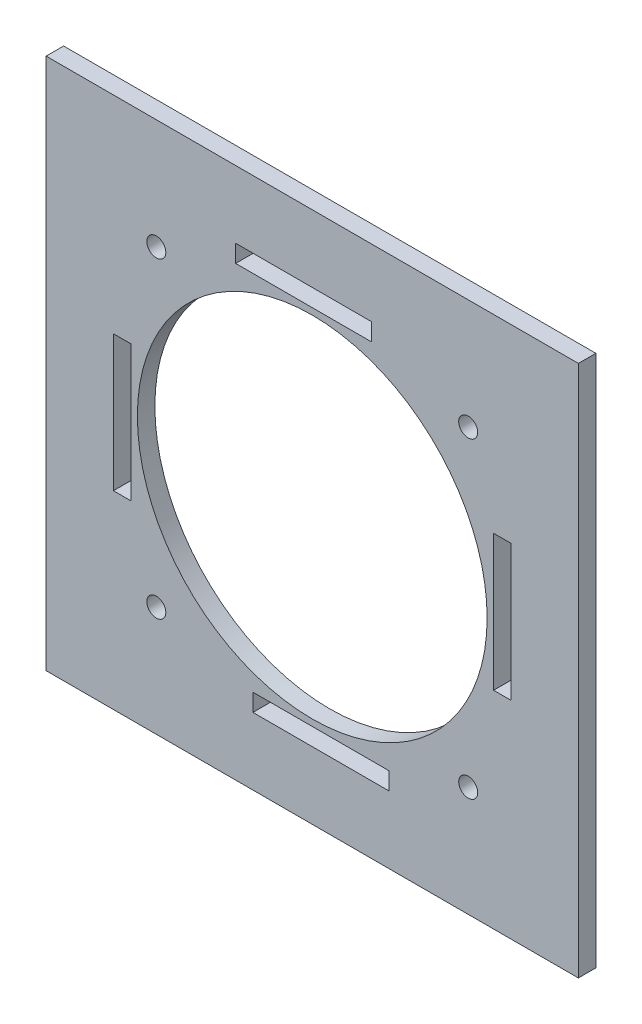
ISO-10303-21;
HEADER;
FILE_DESCRIPTION(('STEP AP214'),'2;1');
FILE_NAME('part.step','',(''),(''),'','','');
FILE_SCHEMA(('AUTOMOTIVE_DESIGN { 1 0 10303 214 1 1 1 1 }'));
ENDSEC;
DATA;
#1=APPLICATION_CONTEXT('core data for automotive mechanical design processes');
#2=APPLICATION_PROTOCOL_DEFINITION('international standard','automotive_design',2000,#1);
#3=PRODUCT_CONTEXT('',#1,'mechanical');
#4=PRODUCT('Part','Part','',(#3));
#5=PRODUCT_RELATED_PRODUCT_CATEGORY('part','',(#4));
#6=PRODUCT_DEFINITION_FORMATION('','',#4);
#7=PRODUCT_DEFINITION_CONTEXT('part definition',#1,'design');
#8=PRODUCT_DEFINITION('design','',#6,#7);
#9=PRODUCT_DEFINITION_SHAPE('','',#8);
#10=(LENGTH_UNIT() NAMED_UNIT(*) SI_UNIT(.MILLI.,.METRE.));
#11=(NAMED_UNIT(*) PLANE_ANGLE_UNIT() SI_UNIT($,.RADIAN.));
#12=(NAMED_UNIT(*) SI_UNIT($,.STERADIAN.) SOLID_ANGLE_UNIT());
#13=UNCERTAINTY_MEASURE_WITH_UNIT(LENGTH_MEASURE(1.E-05),#10,'distance_accuracy_value','');
#14=(GEOMETRIC_REPRESENTATION_CONTEXT(3) GLOBAL_UNCERTAINTY_ASSIGNED_CONTEXT((#13)) GLOBAL_UNIT_ASSIGNED_CONTEXT((#10,
#11,#12)) REPRESENTATION_CONTEXT('',''));
#15=CARTESIAN_POINT('',(0.,0.,0.));
#16=DIRECTION('',(0.,0.,1.));
#17=DIRECTION('',(1.,0.,0.));
#18=AXIS2_PLACEMENT_3D('',#15,#16,#17);
#19=CARTESIAN_POINT('',(70.,70.,4.6));
#20=DIRECTION('',(0.,0.,-1.));
#21=DIRECTION('',(-1.,0.,0.));
#22=AXIS2_PLACEMENT_3D('',#19,#20,#21);
#23=PLANE('',#22);
#24=DIRECTION('',(0.,1.,0.));
#25=VECTOR('',#24,1.);
#26=CARTESIAN_POINT('',(-47.7,-20.1513538884116,4.59999999999999));
#27=LINE('',#26,#25);
#28=CARTESIAN_POINT('',(-47.7,-20.1513538884116,4.59999999999999));
#29=VERTEX_POINT('',#28);
#30=CARTESIAN_POINT('',(-47.7,15.6078197430592,4.6));
#31=VERTEX_POINT('',#30);
#32=EDGE_CURVE('E47',#29,#31,#27,.T.);
#33=ORIENTED_EDGE('',*,*,#32,.F.);
#34=DIRECTION('',(-1.,0.,0.));
#35=VECTOR('',#34,1.);
#36=CARTESIAN_POINT('',(-11.6461722031394,-20.1513538884116,4.59999999999999));
#37=LINE('',#36,#35);
#38=CARTESIAN_POINT('',(-52.3,-20.1513538884116,4.59999999999999));
#39=VERTEX_POINT('',#38);
#40=EDGE_CURVE('E300',#29,#39,#37,.T.);
#41=ORIENTED_EDGE('',*,*,#40,.T.);
#42=DIRECTION('',(0.,1.,0.));
#43=VECTOR('',#42,1.);
#44=CARTESIAN_POINT('',(-52.3,-20.1513538884116,4.59999999999999));
#45=LINE('',#44,#43);
#46=CARTESIAN_POINT('',(-52.3,15.6078197430592,4.59999999999999));
#47=VERTEX_POINT('',#46);
#48=EDGE_CURVE('E293',#39,#47,#45,.T.);
#49=ORIENTED_EDGE('',*,*,#48,.T.);
#50=DIRECTION('',(-1.,0.,0.));
#51=VECTOR('',#50,1.);
#52=CARTESIAN_POINT('',(-11.6461722031394,15.6078197430592,4.6));
#53=LINE('',#52,#51);
#54=EDGE_CURVE('E299',#31,#47,#53,.T.);
#55=ORIENTED_EDGE('',*,*,#54,.F.);
#56=EDGE_LOOP('',(#33,#41,#49,#55));
#57=FACE_BOUND('',#56,.T.);
#58=DIRECTION('',(0.,-1.,0.));
#59=VECTOR('',#58,1.);
#60=CARTESIAN_POINT('',(47.7,20.1513538884117,4.6));
#61=LINE('',#60,#59);
#62=CARTESIAN_POINT('',(47.7,20.1513538884117,4.6));
#63=VERTEX_POINT('',#62);
#64=CARTESIAN_POINT('',(47.7,-15.6078197430591,4.6));
#65=VERTEX_POINT('',#64);
#66=EDGE_CURVE('E55',#63,#65,#61,.T.);
#67=ORIENTED_EDGE('',*,*,#66,.F.);
#68=DIRECTION('',(1.,0.,0.));
#69=VECTOR('',#68,1.);
#70=CARTESIAN_POINT('',(11.6461722031394,20.1513538884117,4.6));
#71=LINE('',#70,#69);
#72=CARTESIAN_POINT('',(52.3,20.1513538884117,4.6));
#73=VERTEX_POINT('',#72);
#74=EDGE_CURVE('E265',#63,#73,#71,.T.);
#75=ORIENTED_EDGE('',*,*,#74,.T.);
#76=DIRECTION('',(0.,-1.,0.));
#77=VECTOR('',#76,1.);
#78=CARTESIAN_POINT('',(52.3,20.1513538884117,4.6));
#79=LINE('',#78,#77);
#80=CARTESIAN_POINT('',(52.3,-15.6078197430591,4.6));
#81=VERTEX_POINT('',#80);
#82=EDGE_CURVE('E258',#73,#81,#79,.T.);
#83=ORIENTED_EDGE('',*,*,#82,.T.);
#84=DIRECTION('',(1.,0.,0.));
#85=VECTOR('',#84,1.);
#86=CARTESIAN_POINT('',(11.6461722031394,-15.6078197430591,4.59999999999999));
#87=LINE('',#86,#85);
#88=EDGE_CURVE('E264',#65,#81,#87,.T.);
#89=ORIENTED_EDGE('',*,*,#88,.F.);
#90=EDGE_LOOP('',(#67,#75,#83,#89));
#91=FACE_BOUND('',#90,.T.);
#92=DIRECTION('',(1.,0.,0.));
#93=VECTOR('',#92,1.);
#94=CARTESIAN_POINT('',(-20.1513538884117,47.7,4.6));
#95=LINE('',#94,#93);
#96=CARTESIAN_POINT('',(-20.1513538884117,47.7,4.6));
#97=VERTEX_POINT('',#96);
#98=CARTESIAN_POINT('',(15.6078197430591,47.7,4.6));
#99=VERTEX_POINT('',#98);
#100=EDGE_CURVE('E226',#97,#99,#95,.T.);
#101=ORIENTED_EDGE('',*,*,#100,.F.);
#102=DIRECTION('',(0.,1.,0.));
#103=VECTOR('',#102,1.);
#104=CARTESIAN_POINT('',(-20.1513538884117,11.6461722031394,4.6));
#105=LINE('',#104,#103);
#106=CARTESIAN_POINT('',(-20.1513538884117,52.3,4.6));
#107=VERTEX_POINT('',#106);
#108=EDGE_CURVE('E229',#97,#107,#105,.T.);
#109=ORIENTED_EDGE('',*,*,#108,.T.);
#110=DIRECTION('',(1.,0.,0.));
#111=VECTOR('',#110,1.);
#112=CARTESIAN_POINT('',(-20.1513538884117,52.3,4.6));
#113=LINE('',#112,#111);
#114=CARTESIAN_POINT('',(15.6078197430591,52.3,4.60000000000001));
#115=VERTEX_POINT('',#114);
#116=EDGE_CURVE('E221',#107,#115,#113,.T.);
#117=ORIENTED_EDGE('',*,*,#116,.T.);
#118=DIRECTION('',(0.,1.,0.));
#119=VECTOR('',#118,1.);
#120=CARTESIAN_POINT('',(15.6078197430591,11.6461722031394,4.6));
#121=LINE('',#120,#119);
#122=EDGE_CURVE('E228',#99,#115,#121,.T.);
#123=ORIENTED_EDGE('',*,*,#122,.F.);
#124=EDGE_LOOP('',(#101,#109,#117,#123));
#125=FACE_BOUND('',#124,.T.);
#126=DIRECTION('',(-1.,0.,0.));
#127=VECTOR('',#126,1.);
#128=CARTESIAN_POINT('',(20.1513538884116,-47.7,4.6));
#129=LINE('',#128,#127);
#130=CARTESIAN_POINT('',(20.1513538884116,-47.7,4.6));
#131=VERTEX_POINT('',#130);
#132=CARTESIAN_POINT('',(-15.6078197430592,-47.7,4.6));
#133=VERTEX_POINT('',#132);
#134=EDGE_CURVE('E572',#131,#133,#129,.T.);
#135=ORIENTED_EDGE('',*,*,#134,.F.);
#136=DIRECTION('',(0.,-1.,0.));
#137=VECTOR('',#136,1.);
#138=CARTESIAN_POINT('',(20.1513538884116,-11.6461722031394,4.60000000000001));
#139=LINE('',#138,#137);
#140=CARTESIAN_POINT('',(20.1513538884116,-52.3,4.6));
#141=VERTEX_POINT('',#140);
#142=EDGE_CURVE('E190',#131,#141,#139,.T.);
#143=ORIENTED_EDGE('',*,*,#142,.T.);
#144=DIRECTION('',(-1.,0.,0.));
#145=VECTOR('',#144,1.);
#146=CARTESIAN_POINT('',(20.1513538884116,-52.3,4.6));
#147=LINE('',#146,#145);
#148=CARTESIAN_POINT('',(-15.6078197430592,-52.3,4.6));
#149=VERTEX_POINT('',#148);
#150=EDGE_CURVE('E195',#141,#149,#147,.T.);
#151=ORIENTED_EDGE('',*,*,#150,.T.);
#152=DIRECTION('',(0.,-1.,0.));
#153=VECTOR('',#152,1.);
#154=CARTESIAN_POINT('',(-15.6078197430592,-11.6461722031394,4.6));
#155=LINE('',#154,#153);
#156=EDGE_CURVE('E569',#133,#149,#155,.T.);
#157=ORIENTED_EDGE('',*,*,#156,.F.);
#158=EDGE_LOOP('',(#135,#143,#151,#157));
#159=FACE_BOUND('',#158,.T.);
#160=CARTESIAN_POINT('',(0.,0.,4.6));
#161=DIRECTION('',(0.,0.,-1.));
#162=DIRECTION('',(-1.,0.,0.));
#163=AXIS2_PLACEMENT_3D('',#160,#161,#162);
#164=CIRCLE('',#163,46.);
#165=CARTESIAN_POINT('',(-46.,0.,4.6));
#166=VERTEX_POINT('',#165);
#167=EDGE_CURVE('E324',#166,#166,#164,.T.);
#168=ORIENTED_EDGE('',*,*,#167,.T.);
#169=EDGE_LOOP('',(#168));
#170=FACE_BOUND('',#169,.T.);
#171=DIRECTION('',(0.,1.,0.));
#172=VECTOR('',#171,1.);
#173=CARTESIAN_POINT('',(70.,-70.,4.6));
#174=LINE('',#173,#172);
#175=CARTESIAN_POINT('',(70.,-70.,4.6));
#176=VERTEX_POINT('',#175);
#177=CARTESIAN_POINT('',(70.,70.,4.6));
#178=VERTEX_POINT('',#177);
#179=EDGE_CURVE('E343',#176,#178,#174,.T.);
#180=ORIENTED_EDGE('',*,*,#179,.T.);
#181=DIRECTION('',(-1.,0.,0.));
#182=VECTOR('',#181,1.);
#183=CARTESIAN_POINT('',(-70.,70.,4.6));
#184=LINE('',#183,#182);
#185=CARTESIAN_POINT('',(-70.,70.,4.6));
#186=VERTEX_POINT('',#185);
#187=EDGE_CURVE('E346',#178,#186,#184,.T.);
#188=ORIENTED_EDGE('',*,*,#187,.T.);
#189=DIRECTION('',(0.,-1.,0.));
#190=VECTOR('',#189,1.);
#191=CARTESIAN_POINT('',(-70.,-70.,4.6));
#192=LINE('',#191,#190);
#193=CARTESIAN_POINT('',(-70.,-70.,4.6));
#194=VERTEX_POINT('',#193);
#195=EDGE_CURVE('E349',#186,#194,#192,.T.);
#196=ORIENTED_EDGE('',*,*,#195,.T.);
#197=DIRECTION('',(1.,0.,0.));
#198=VECTOR('',#197,1.);
#199=CARTESIAN_POINT('',(-70.,-70.,4.6));
#200=LINE('',#199,#198);
#201=EDGE_CURVE('E351',#194,#176,#200,.T.);
#202=ORIENTED_EDGE('',*,*,#201,.T.);
#203=EDGE_LOOP('',(#180,#188,#196,#202));
#204=FACE_BOUND('',#203,.T.);
#205=CARTESIAN_POINT('',(-41.0200000000004,41.0199999999996,4.6));
#206=DIRECTION('',(0.,0.,-1.));
#207=DIRECTION('',(-1.,0.,0.));
#208=AXIS2_PLACEMENT_3D('',#205,#206,#207);
#209=CIRCLE('',#208,2.5);
#210=CARTESIAN_POINT('',(-43.5200000000004,41.0199999999996,4.6));
#211=VERTEX_POINT('',#210);
#212=EDGE_CURVE('E330',#211,#211,#209,.T.);
#213=ORIENTED_EDGE('',*,*,#212,.T.);
#214=EDGE_LOOP('',(#213));
#215=FACE_BOUND('',#214,.T.);
#216=CARTESIAN_POINT('',(41.0199999999997,41.0200000000003,4.6));
#217=DIRECTION('',(0.,0.,-1.));
#218=DIRECTION('',(-1.,0.,0.));
#219=AXIS2_PLACEMENT_3D('',#216,#217,#218);
#220=CIRCLE('',#219,2.5);
#221=CARTESIAN_POINT('',(38.5199999999997,41.0200000000003,4.6));
#222=VERTEX_POINT('',#221);
#223=EDGE_CURVE('E333',#222,#222,#220,.T.);
#224=ORIENTED_EDGE('',*,*,#223,.T.);
#225=EDGE_LOOP('',(#224));
#226=FACE_BOUND('',#225,.T.);
#227=CARTESIAN_POINT('',(41.0200000000002,-41.0199999999998,4.6));
#228=DIRECTION('',(0.,0.,-1.));
#229=DIRECTION('',(-1.,0.,0.));
#230=AXIS2_PLACEMENT_3D('',#227,#228,#229);
#231=CIRCLE('',#230,2.5);
#232=CARTESIAN_POINT('',(38.5200000000002,-41.0199999999998,4.6));
#233=VERTEX_POINT('',#232);
#234=EDGE_CURVE('E336',#233,#233,#231,.T.);
#235=ORIENTED_EDGE('',*,*,#234,.T.);
#236=EDGE_LOOP('',(#235));
#237=FACE_BOUND('',#236,.T.);
#238=CARTESIAN_POINT('',(-41.02,-41.02,4.6));
#239=DIRECTION('',(0.,0.,-1.));
#240=DIRECTION('',(-1.,0.,0.));
#241=AXIS2_PLACEMENT_3D('',#238,#239,#240);
#242=CIRCLE('',#241,2.5);
#243=CARTESIAN_POINT('',(-43.52,-41.02,4.6));
#244=VERTEX_POINT('',#243);
#245=EDGE_CURVE('E339',#244,#244,#242,.T.);
#246=ORIENTED_EDGE('',*,*,#245,.T.);
#247=EDGE_LOOP('',(#246));
#248=FACE_BOUND('',#247,.T.);
#249=ADVANCED_FACE('F31',(#57,#91,#125,#159,#170,#204,#215,#226,#237,#248),#23,.F.);
#250=CARTESIAN_POINT('',(70.,70.,0.));
#251=DIRECTION('',(0.,0.,-1.));
#252=DIRECTION('',(-1.,0.,0.));
#253=AXIS2_PLACEMENT_3D('',#250,#251,#252);
#254=PLANE('',#253);
#255=DIRECTION('',(-1.,0.,0.));
#256=VECTOR('',#255,1.);
#257=CARTESIAN_POINT('',(-11.6461722031394,15.6078197430592,0.));
#258=LINE('',#257,#256);
#259=CARTESIAN_POINT('',(-47.7,15.6078197430592,0.));
#260=VERTEX_POINT('',#259);
#261=CARTESIAN_POINT('',(-52.3,15.6078197430592,0.));
#262=VERTEX_POINT('',#261);
#263=EDGE_CURVE('E319',#260,#262,#258,.T.);
#264=ORIENTED_EDGE('',*,*,#263,.T.);
#265=DIRECTION('',(0.,-1.,0.));
#266=VECTOR('',#265,1.);
#267=CARTESIAN_POINT('',(-52.3,70.,0.));
#268=LINE('',#267,#266);
#269=CARTESIAN_POINT('',(-52.3,-20.1513538884116,0.));
#270=VERTEX_POINT('',#269);
#271=EDGE_CURVE('E399',#262,#270,#268,.T.);
#272=ORIENTED_EDGE('',*,*,#271,.T.);
#273=DIRECTION('',(-1.,0.,0.));
#274=VECTOR('',#273,1.);
#275=CARTESIAN_POINT('',(-11.6461722031394,-20.1513538884116,0.));
#276=LINE('',#275,#274);
#277=CARTESIAN_POINT('',(-47.7,-20.1513538884116,0.));
#278=VERTEX_POINT('',#277);
#279=EDGE_CURVE('E296',#278,#270,#276,.T.);
#280=ORIENTED_EDGE('',*,*,#279,.F.);
#281=DIRECTION('',(0.,-1.,0.));
#282=VECTOR('',#281,1.);
#283=CARTESIAN_POINT('',(-47.7,70.,0.));
#284=LINE('',#283,#282);
#285=EDGE_CURVE('E11',#260,#278,#284,.T.);
#286=ORIENTED_EDGE('',*,*,#285,.F.);
#287=EDGE_LOOP('',(#264,#272,#280,#286));
#288=FACE_BOUND('',#287,.T.);
#289=DIRECTION('',(0.,-1.,0.));
#290=VECTOR('',#289,1.);
#291=CARTESIAN_POINT('',(-15.6078197430592,-11.6461722031394,0.));
#292=LINE('',#291,#290);
#293=CARTESIAN_POINT('',(-15.6078197430592,-47.7,0.));
#294=VERTEX_POINT('',#293);
#295=CARTESIAN_POINT('',(-15.6078197430592,-52.3,0.));
#296=VERTEX_POINT('',#295);
#297=EDGE_CURVE('E211',#294,#296,#292,.T.);
#298=ORIENTED_EDGE('',*,*,#297,.T.);
#299=DIRECTION('',(1.,0.,0.));
#300=VECTOR('',#299,1.);
#301=CARTESIAN_POINT('',(70.,-52.3,0.));
#302=LINE('',#301,#300);
#303=CARTESIAN_POINT('',(20.1513538884116,-52.3,0.));
#304=VERTEX_POINT('',#303);
#305=EDGE_CURVE('E181',#296,#304,#302,.T.);
#306=ORIENTED_EDGE('',*,*,#305,.T.);
#307=DIRECTION('',(0.,-1.,0.));
#308=VECTOR('',#307,1.);
#309=CARTESIAN_POINT('',(20.1513538884116,-11.6461722031394,0.));
#310=LINE('',#309,#308);
#311=CARTESIAN_POINT('',(20.1513538884116,-47.7,0.));
#312=VERTEX_POINT('',#311);
#313=EDGE_CURVE('E187',#312,#304,#310,.T.);
#314=ORIENTED_EDGE('',*,*,#313,.F.);
#315=DIRECTION('',(1.,0.,0.));
#316=VECTOR('',#315,1.);
#317=CARTESIAN_POINT('',(70.,-47.7,0.));
#318=LINE('',#317,#316);
#319=EDGE_CURVE('E170',#294,#312,#318,.T.);
#320=ORIENTED_EDGE('',*,*,#319,.F.);
#321=EDGE_LOOP('',(#298,#306,#314,#320));
#322=FACE_BOUND('',#321,.T.);
#323=DIRECTION('',(0.,1.,0.));
#324=VECTOR('',#323,1.);
#325=CARTESIAN_POINT('',(15.6078197430591,11.6461722031394,0.));
#326=LINE('',#325,#324);
#327=CARTESIAN_POINT('',(15.6078197430591,47.7,0.));
#328=VERTEX_POINT('',#327);
#329=CARTESIAN_POINT('',(15.6078197430591,52.3,0.));
#330=VERTEX_POINT('',#329);
#331=EDGE_CURVE('E249',#328,#330,#326,.T.);
#332=ORIENTED_EDGE('',*,*,#331,.T.);
#333=DIRECTION('',(-1.,0.,0.));
#334=VECTOR('',#333,1.);
#335=CARTESIAN_POINT('',(70.,52.3,0.));
#336=LINE('',#335,#334);
#337=CARTESIAN_POINT('',(-20.1513538884117,52.3,0.));
#338=VERTEX_POINT('',#337);
#339=EDGE_CURVE('E405',#330,#338,#336,.T.);
#340=ORIENTED_EDGE('',*,*,#339,.T.);
#341=DIRECTION('',(0.,1.,0.));
#342=VECTOR('',#341,1.);
#343=CARTESIAN_POINT('',(-20.1513538884117,11.6461722031394,0.));
#344=LINE('',#343,#342);
#345=CARTESIAN_POINT('',(-20.1513538884117,47.7,0.));
#346=VERTEX_POINT('',#345);
#347=EDGE_CURVE('E224',#346,#338,#344,.T.);
#348=ORIENTED_EDGE('',*,*,#347,.F.);
#349=DIRECTION('',(-1.,0.,0.));
#350=VECTOR('',#349,1.);
#351=CARTESIAN_POINT('',(70.,47.7,0.));
#352=LINE('',#351,#350);
#353=EDGE_CURVE('E396',#328,#346,#352,.T.);
#354=ORIENTED_EDGE('',*,*,#353,.F.);
#355=EDGE_LOOP('',(#332,#340,#348,#354));
#356=FACE_BOUND('',#355,.T.);
#357=DIRECTION('',(1.,0.,0.));
#358=VECTOR('',#357,1.);
#359=CARTESIAN_POINT('',(11.6461722031394,-15.6078197430591,0.));
#360=LINE('',#359,#358);
#361=CARTESIAN_POINT('',(47.7,-15.6078197430591,0.));
#362=VERTEX_POINT('',#361);
#363=CARTESIAN_POINT('',(52.3,-15.6078197430591,0.));
#364=VERTEX_POINT('',#363);
#365=EDGE_CURVE('E284',#362,#364,#360,.T.);
#366=ORIENTED_EDGE('',*,*,#365,.T.);
#367=DIRECTION('',(0.,1.,0.));
#368=VECTOR('',#367,1.);
#369=CARTESIAN_POINT('',(52.3,70.,0.));
#370=LINE('',#369,#368);
#371=CARTESIAN_POINT('',(52.3,20.1513538884117,0.));
#372=VERTEX_POINT('',#371);
#373=EDGE_CURVE('E389',#364,#372,#370,.T.);
#374=ORIENTED_EDGE('',*,*,#373,.T.);
#375=DIRECTION('',(1.,0.,0.));
#376=VECTOR('',#375,1.);
#377=CARTESIAN_POINT('',(11.6461722031394,20.1513538884117,0.));
#378=LINE('',#377,#376);
#379=CARTESIAN_POINT('',(47.7,20.1513538884117,0.));
#380=VERTEX_POINT('',#379);
#381=EDGE_CURVE('E261',#380,#372,#378,.T.);
#382=ORIENTED_EDGE('',*,*,#381,.F.);
#383=DIRECTION('',(0.,1.,0.));
#384=VECTOR('',#383,1.);
#385=CARTESIAN_POINT('',(47.7,70.,0.));
#386=LINE('',#385,#384);
#387=EDGE_CURVE('E40',#362,#380,#386,.T.);
#388=ORIENTED_EDGE('',*,*,#387,.F.);
#389=EDGE_LOOP('',(#366,#374,#382,#388));
#390=FACE_BOUND('',#389,.T.);
#391=CARTESIAN_POINT('',(-41.02,-41.02,0.));
#392=DIRECTION('',(0.,0.,-1.));
#393=DIRECTION('',(-1.,0.,0.));
#394=AXIS2_PLACEMENT_3D('',#391,#392,#393);
#395=CIRCLE('',#394,2.5);
#396=CARTESIAN_POINT('',(-43.52,-41.02,0.));
#397=VERTEX_POINT('',#396);
#398=EDGE_CURVE('E358',#397,#397,#395,.F.);
#399=ORIENTED_EDGE('',*,*,#398,.T.);
#400=EDGE_LOOP('',(#399));
#401=FACE_BOUND('',#400,.T.);
#402=CARTESIAN_POINT('',(41.0199999999997,41.0200000000003,0.));
#403=DIRECTION('',(0.,0.,-1.));
#404=DIRECTION('',(-1.,0.,0.));
#405=AXIS2_PLACEMENT_3D('',#402,#403,#404);
#406=CIRCLE('',#405,2.5);
#407=CARTESIAN_POINT('',(38.5199999999997,41.0200000000003,0.));
#408=VERTEX_POINT('',#407);
#409=EDGE_CURVE('E378',#408,#408,#406,.F.);
#410=ORIENTED_EDGE('',*,*,#409,.T.);
#411=EDGE_LOOP('',(#410));
#412=FACE_BOUND('',#411,.T.);
#413=CARTESIAN_POINT('',(0.,0.,0.));
#414=DIRECTION('',(0.,0.,-1.));
#415=DIRECTION('',(-1.,0.,0.));
#416=AXIS2_PLACEMENT_3D('',#413,#414,#415);
#417=CIRCLE('',#416,46.);
#418=CARTESIAN_POINT('',(-46.,0.,0.));
#419=VERTEX_POINT('',#418);
#420=EDGE_CURVE('E342',#419,#419,#417,.F.);
#421=ORIENTED_EDGE('',*,*,#420,.T.);
#422=EDGE_LOOP('',(#421));
#423=FACE_BOUND('',#422,.T.);
#424=CARTESIAN_POINT('',(-41.0200000000004,41.0199999999996,0.));
#425=DIRECTION('',(0.,0.,-1.));
#426=DIRECTION('',(-1.,0.,0.));
#427=AXIS2_PLACEMENT_3D('',#424,#425,#426);
#428=CIRCLE('',#427,2.5);
#429=CARTESIAN_POINT('',(-43.5200000000004,41.0199999999996,0.));
#430=VERTEX_POINT('',#429);
#431=EDGE_CURVE('E375',#430,#430,#428,.F.);
#432=ORIENTED_EDGE('',*,*,#431,.T.);
#433=EDGE_LOOP('',(#432));
#434=FACE_BOUND('',#433,.T.);
#435=CARTESIAN_POINT('',(41.0200000000002,-41.0199999999998,0.));
#436=DIRECTION('',(0.,0.,-1.));
#437=DIRECTION('',(-1.,0.,0.));
#438=AXIS2_PLACEMENT_3D('',#435,#436,#437);
#439=CIRCLE('',#438,2.5);
#440=CARTESIAN_POINT('',(38.5200000000002,-41.0199999999998,0.));
#441=VERTEX_POINT('',#440);
#442=EDGE_CURVE('E381',#441,#441,#439,.F.);
#443=ORIENTED_EDGE('',*,*,#442,.T.);
#444=EDGE_LOOP('',(#443));
#445=FACE_BOUND('',#444,.T.);
#446=DIRECTION('',(0.,1.,0.));
#447=VECTOR('',#446,1.);
#448=CARTESIAN_POINT('',(70.,-70.,0.));
#449=LINE('',#448,#447);
#450=CARTESIAN_POINT('',(70.,-70.,0.));
#451=VERTEX_POINT('',#450);
#452=CARTESIAN_POINT('',(70.,70.,0.));
#453=VERTEX_POINT('',#452);
#454=EDGE_CURVE('E354',#451,#453,#449,.T.);
#455=ORIENTED_EDGE('',*,*,#454,.F.);
#456=DIRECTION('',(1.,0.,0.));
#457=VECTOR('',#456,1.);
#458=CARTESIAN_POINT('',(-70.,-70.,0.));
#459=LINE('',#458,#457);
#460=CARTESIAN_POINT('',(-70.,-70.,0.));
#461=VERTEX_POINT('',#460);
#462=EDGE_CURVE('E347',#461,#451,#459,.T.);
#463=ORIENTED_EDGE('',*,*,#462,.F.);
#464=DIRECTION('',(0.,-1.,0.));
#465=VECTOR('',#464,1.);
#466=CARTESIAN_POINT('',(-70.,-70.,0.));
#467=LINE('',#466,#465);
#468=CARTESIAN_POINT('',(-70.,70.,0.));
#469=VERTEX_POINT('',#468);
#470=EDGE_CURVE('E360',#469,#461,#467,.T.);
#471=ORIENTED_EDGE('',*,*,#470,.F.);
#472=DIRECTION('',(-1.,0.,0.));
#473=VECTOR('',#472,1.);
#474=CARTESIAN_POINT('',(-70.,70.,0.));
#475=LINE('',#474,#473);
#476=EDGE_CURVE('E357',#453,#469,#475,.T.);
#477=ORIENTED_EDGE('',*,*,#476,.F.);
#478=EDGE_LOOP('',(#455,#463,#471,#477));
#479=FACE_BOUND('',#478,.T.);
#480=ADVANCED_FACE('F192',(#288,#322,#356,#390,#401,#412,#423,#434,#445,#479),#254,.T.);
#481=CARTESIAN_POINT('',(70.,-70.,4.6));
#482=DIRECTION('',(-1.,0.,0.));
#483=DIRECTION('',(0.,0.,1.));
#484=AXIS2_PLACEMENT_3D('',#481,#482,#483);
#485=PLANE('',#484);
#486=ORIENTED_EDGE('',*,*,#454,.T.);
#487=DIRECTION('',(0.,0.,-1.));
#488=VECTOR('',#487,1.);
#489=CARTESIAN_POINT('',(70.,70.,4.6));
#490=LINE('',#489,#488);
#491=EDGE_CURVE('E182',#178,#453,#490,.T.);
#492=ORIENTED_EDGE('',*,*,#491,.F.);
#493=ORIENTED_EDGE('',*,*,#179,.F.);
#494=DIRECTION('',(0.,0.,-1.));
#495=VECTOR('',#494,1.);
#496=CARTESIAN_POINT('',(70.,-70.,4.6));
#497=LINE('',#496,#495);
#498=EDGE_CURVE('E353',#176,#451,#497,.T.);
#499=ORIENTED_EDGE('',*,*,#498,.T.);
#500=EDGE_LOOP('',(#486,#492,#493,#499));
#501=FACE_BOUND('',#500,.T.);
#502=ADVANCED_FACE('F33',(#501),#485,.F.);
#503=CARTESIAN_POINT('',(-70.,70.,4.6));
#504=DIRECTION('',(0.,-1.,0.));
#505=DIRECTION('',(0.,0.,-1.));
#506=AXIS2_PLACEMENT_3D('',#503,#504,#505);
#507=PLANE('',#506);
#508=ORIENTED_EDGE('',*,*,#476,.T.);
#509=DIRECTION('',(0.,0.,-1.));
#510=VECTOR('',#509,1.);
#511=CARTESIAN_POINT('',(-70.,70.,4.6));
#512=LINE('',#511,#510);
#513=EDGE_CURVE('E368',#186,#469,#512,.T.);
#514=ORIENTED_EDGE('',*,*,#513,.F.);
#515=ORIENTED_EDGE('',*,*,#187,.F.);
#516=ORIENTED_EDGE('',*,*,#491,.T.);
#517=EDGE_LOOP('',(#508,#514,#515,#516));
#518=FACE_BOUND('',#517,.T.);
#519=ADVANCED_FACE('F454',(#518),#507,.F.);
#520=CARTESIAN_POINT('',(-70.,-70.,4.6));
#521=DIRECTION('',(1.,0.,0.));
#522=DIRECTION('',(0.,0.,-1.));
#523=AXIS2_PLACEMENT_3D('',#520,#521,#522);
#524=PLANE('',#523);
#525=ORIENTED_EDGE('',*,*,#470,.T.);
#526=DIRECTION('',(0.,0.,-1.));
#527=VECTOR('',#526,1.);
#528=CARTESIAN_POINT('',(-70.,-70.,4.6));
#529=LINE('',#528,#527);
#530=EDGE_CURVE('E365',#194,#461,#529,.T.);
#531=ORIENTED_EDGE('',*,*,#530,.F.);
#532=ORIENTED_EDGE('',*,*,#195,.F.);
#533=ORIENTED_EDGE('',*,*,#513,.T.);
#534=EDGE_LOOP('',(#525,#531,#532,#533));
#535=FACE_BOUND('',#534,.T.);
#536=ADVANCED_FACE('F451',(#535),#524,.F.);
#537=CARTESIAN_POINT('',(-70.,-70.,4.6));
#538=DIRECTION('',(0.,1.,0.));
#539=DIRECTION('',(0.,0.,1.));
#540=AXIS2_PLACEMENT_3D('',#537,#538,#539);
#541=PLANE('',#540);
#542=ORIENTED_EDGE('',*,*,#462,.T.);
#543=ORIENTED_EDGE('',*,*,#498,.F.);
#544=ORIENTED_EDGE('',*,*,#201,.F.);
#545=ORIENTED_EDGE('',*,*,#530,.T.);
#546=EDGE_LOOP('',(#542,#543,#544,#545));
#547=FACE_BOUND('',#546,.T.);
#548=ADVANCED_FACE('F447',(#547),#541,.F.);
#549=CARTESIAN_POINT('',(0.,0.,-5.4));
#550=DIRECTION('',(0.,0.,1.));
#551=DIRECTION('',(1.,0.,0.));
#552=AXIS2_PLACEMENT_3D('',#549,#550,#551);
#553=CYLINDRICAL_SURFACE('',#552,46.);
#554=ORIENTED_EDGE('',*,*,#420,.F.);
#555=EDGE_LOOP('',(#554));
#556=FACE_BOUND('',#555,.T.);
#557=ORIENTED_EDGE('',*,*,#167,.F.);
#558=EDGE_LOOP('',(#557));
#559=FACE_BOUND('',#558,.T.);
#560=ADVANCED_FACE('F450',(#556,#559),#553,.F.);
#561=CARTESIAN_POINT('',(-41.0200000000004,41.0199999999996,-5.4));
#562=DIRECTION('',(0.,0.,1.));
#563=DIRECTION('',(1.,0.,0.));
#564=AXIS2_PLACEMENT_3D('',#561,#562,#563);
#565=CYLINDRICAL_SURFACE('',#564,2.5);
#566=ORIENTED_EDGE('',*,*,#431,.F.);
#567=EDGE_LOOP('',(#566));
#568=FACE_BOUND('',#567,.T.);
#569=ORIENTED_EDGE('',*,*,#212,.F.);
#570=EDGE_LOOP('',(#569));
#571=FACE_BOUND('',#570,.T.);
#572=ADVANCED_FACE('F506',(#568,#571),#565,.F.);
#573=CARTESIAN_POINT('',(41.0199999999997,41.0200000000003,-5.4));
#574=DIRECTION('',(0.,0.,1.));
#575=DIRECTION('',(1.,0.,0.));
#576=AXIS2_PLACEMENT_3D('',#573,#574,#575);
#577=CYLINDRICAL_SURFACE('',#576,2.5);
#578=ORIENTED_EDGE('',*,*,#409,.F.);
#579=EDGE_LOOP('',(#578));
#580=FACE_BOUND('',#579,.T.);
#581=ORIENTED_EDGE('',*,*,#223,.F.);
#582=EDGE_LOOP('',(#581));
#583=FACE_BOUND('',#582,.T.);
#584=ADVANCED_FACE('F492',(#580,#583),#577,.F.);
#585=CARTESIAN_POINT('',(41.0200000000002,-41.0199999999998,-5.4));
#586=DIRECTION('',(0.,0.,1.));
#587=DIRECTION('',(1.,0.,0.));
#588=AXIS2_PLACEMENT_3D('',#585,#586,#587);
#589=CYLINDRICAL_SURFACE('',#588,2.5);
#590=ORIENTED_EDGE('',*,*,#442,.F.);
#591=EDGE_LOOP('',(#590));
#592=FACE_BOUND('',#591,.T.);
#593=ORIENTED_EDGE('',*,*,#234,.F.);
#594=EDGE_LOOP('',(#593));
#595=FACE_BOUND('',#594,.T.);
#596=ADVANCED_FACE('F484',(#592,#595),#589,.F.);
#597=CARTESIAN_POINT('',(-41.02,-41.02,-5.4));
#598=DIRECTION('',(0.,0.,1.));
#599=DIRECTION('',(1.,0.,0.));
#600=AXIS2_PLACEMENT_3D('',#597,#598,#599);
#601=CYLINDRICAL_SURFACE('',#600,2.5);
#602=ORIENTED_EDGE('',*,*,#398,.F.);
#603=EDGE_LOOP('',(#602));
#604=FACE_BOUND('',#603,.T.);
#605=ORIENTED_EDGE('',*,*,#245,.F.);
#606=EDGE_LOOP('',(#605));
#607=FACE_BOUND('',#606,.T.);
#608=ADVANCED_FACE('F444',(#604,#607),#601,.F.);
#609=CARTESIAN_POINT('',(20.1513538884116,-11.6461722031394,0.));
#610=DIRECTION('',(1.,0.,0.));
#611=DIRECTION('',(0.,-1.,0.));
#612=AXIS2_PLACEMENT_3D('',#609,#610,#611);
#613=PLANE('',#612);
#614=ORIENTED_EDGE('',*,*,#313,.T.);
#615=DIRECTION('',(0.,0.,1.));
#616=VECTOR('',#615,1.);
#617=CARTESIAN_POINT('',(20.1513538884116,-52.3,0.));
#618=LINE('',#617,#616);
#619=EDGE_CURVE('E198',#304,#141,#618,.T.);
#620=ORIENTED_EDGE('',*,*,#619,.T.);
#621=ORIENTED_EDGE('',*,*,#142,.F.);
#622=DIRECTION('',(0.,0.,1.));
#623=VECTOR('',#622,1.);
#624=CARTESIAN_POINT('',(20.1513538884116,-47.7,0.));
#625=LINE('',#624,#623);
#626=EDGE_CURVE('E173',#312,#131,#625,.T.);
#627=ORIENTED_EDGE('',*,*,#626,.F.);
#628=EDGE_LOOP('',(#614,#620,#621,#627));
#629=FACE_BOUND('',#628,.T.);
#630=ADVANCED_FACE('F186',(#629),#613,.F.);
#631=CARTESIAN_POINT('',(-15.6078197430592,-11.6461722031394,0.));
#632=DIRECTION('',(-1.,0.,0.));
#633=DIRECTION('',(0.,1.,0.));
#634=AXIS2_PLACEMENT_3D('',#631,#632,#633);
#635=PLANE('',#634);
#636=ORIENTED_EDGE('',*,*,#156,.T.);
#637=DIRECTION('',(0.,0.,-1.));
#638=VECTOR('',#637,1.);
#639=CARTESIAN_POINT('',(-15.6078197430592,-52.3,0.));
#640=LINE('',#639,#638);
#641=EDGE_CURVE('E217',#149,#296,#640,.T.);
#642=ORIENTED_EDGE('',*,*,#641,.T.);
#643=ORIENTED_EDGE('',*,*,#297,.F.);
#644=DIRECTION('',(0.,0.,-1.));
#645=VECTOR('',#644,1.);
#646=CARTESIAN_POINT('',(-15.6078197430592,-47.7,0.));
#647=LINE('',#646,#645);
#648=EDGE_CURVE('E176',#133,#294,#647,.T.);
#649=ORIENTED_EDGE('',*,*,#648,.F.);
#650=EDGE_LOOP('',(#636,#642,#643,#649));
#651=FACE_BOUND('',#650,.T.);
#652=ADVANCED_FACE('F490',(#651),#635,.F.);
#653=CARTESIAN_POINT('',(52.3,-47.7,-100.));
#654=DIRECTION('',(0.,1.,0.));
#655=DIRECTION('',(1.,0.,0.));
#656=AXIS2_PLACEMENT_3D('',#653,#654,#655);
#657=PLANE('',#656);
#658=ORIENTED_EDGE('',*,*,#319,.T.);
#659=ORIENTED_EDGE('',*,*,#626,.T.);
#660=ORIENTED_EDGE('',*,*,#134,.T.);
#661=ORIENTED_EDGE('',*,*,#648,.T.);
#662=EDGE_LOOP('',(#658,#659,#660,#661));
#663=FACE_BOUND('',#662,.T.);
#664=ADVANCED_FACE('F172',(#663),#657,.F.);
#665=CARTESIAN_POINT('',(-52.3,-52.3,0.));
#666=DIRECTION('',(0.,1.,0.));
#667=DIRECTION('',(1.,0.,0.));
#668=AXIS2_PLACEMENT_3D('',#665,#666,#667);
#669=PLANE('',#668);
#670=ORIENTED_EDGE('',*,*,#641,.F.);
#671=ORIENTED_EDGE('',*,*,#150,.F.);
#672=ORIENTED_EDGE('',*,*,#619,.F.);
#673=ORIENTED_EDGE('',*,*,#305,.F.);
#674=EDGE_LOOP('',(#670,#671,#672,#673));
#675=FACE_BOUND('',#674,.T.);
#676=ADVANCED_FACE('F519',(#675),#669,.T.);
#677=CARTESIAN_POINT('',(-20.1513538884117,11.6461722031394,0.));
#678=DIRECTION('',(-1.,0.,0.));
#679=DIRECTION('',(0.,1.,0.));
#680=AXIS2_PLACEMENT_3D('',#677,#678,#679);
#681=PLANE('',#680);
#682=ORIENTED_EDGE('',*,*,#347,.T.);
#683=DIRECTION('',(0.,0.,1.));
#684=VECTOR('',#683,1.);
#685=CARTESIAN_POINT('',(-20.1513538884117,52.3,0.));
#686=LINE('',#685,#684);
#687=EDGE_CURVE('E225',#338,#107,#686,.T.);
#688=ORIENTED_EDGE('',*,*,#687,.T.);
#689=ORIENTED_EDGE('',*,*,#108,.F.);
#690=DIRECTION('',(0.,0.,1.));
#691=VECTOR('',#690,1.);
#692=CARTESIAN_POINT('',(-20.1513538884117,47.7,0.));
#693=LINE('',#692,#691);
#694=EDGE_CURVE('E234',#346,#97,#693,.T.);
#695=ORIENTED_EDGE('',*,*,#694,.F.);
#696=EDGE_LOOP('',(#682,#688,#689,#695));
#697=FACE_BOUND('',#696,.T.);
#698=ADVANCED_FACE('F522',(#697),#681,.F.);
#699=CARTESIAN_POINT('',(15.6078197430591,11.6461722031394,0.));
#700=DIRECTION('',(1.,0.,0.));
#701=DIRECTION('',(0.,-1.,0.));
#702=AXIS2_PLACEMENT_3D('',#699,#700,#701);
#703=PLANE('',#702);
#704=ORIENTED_EDGE('',*,*,#122,.T.);
#705=DIRECTION('',(0.,0.,-1.));
#706=VECTOR('',#705,1.);
#707=CARTESIAN_POINT('',(15.6078197430591,52.3,0.));
#708=LINE('',#707,#706);
#709=EDGE_CURVE('E214',#115,#330,#708,.T.);
#710=ORIENTED_EDGE('',*,*,#709,.T.);
#711=ORIENTED_EDGE('',*,*,#331,.F.);
#712=DIRECTION('',(0.,0.,-1.));
#713=VECTOR('',#712,1.);
#714=CARTESIAN_POINT('',(15.6078197430591,47.7,0.));
#715=LINE('',#714,#713);
#716=EDGE_CURVE('E231',#99,#328,#715,.T.);
#717=ORIENTED_EDGE('',*,*,#716,.F.);
#718=EDGE_LOOP('',(#704,#710,#711,#717));
#719=FACE_BOUND('',#718,.T.);
#720=ADVANCED_FACE('F554',(#719),#703,.F.);
#721=CARTESIAN_POINT('',(-52.3,47.7,-100.));
#722=DIRECTION('',(0.,-1.,0.));
#723=DIRECTION('',(-1.,0.,0.));
#724=AXIS2_PLACEMENT_3D('',#721,#722,#723);
#725=PLANE('',#724);
#726=ORIENTED_EDGE('',*,*,#353,.T.);
#727=ORIENTED_EDGE('',*,*,#694,.T.);
#728=ORIENTED_EDGE('',*,*,#100,.T.);
#729=ORIENTED_EDGE('',*,*,#716,.T.);
#730=EDGE_LOOP('',(#726,#727,#728,#729));
#731=FACE_BOUND('',#730,.T.);
#732=ADVANCED_FACE('F528',(#731),#725,.F.);
#733=CARTESIAN_POINT('',(-52.3,52.3,-28.6963359750619));
#734=DIRECTION('',(0.,-1.,0.));
#735=DIRECTION('',(-1.,0.,0.));
#736=AXIS2_PLACEMENT_3D('',#733,#734,#735);
#737=PLANE('',#736);
#738=ORIENTED_EDGE('',*,*,#709,.F.);
#739=ORIENTED_EDGE('',*,*,#116,.F.);
#740=ORIENTED_EDGE('',*,*,#687,.F.);
#741=ORIENTED_EDGE('',*,*,#339,.F.);
#742=EDGE_LOOP('',(#738,#739,#740,#741));
#743=FACE_BOUND('',#742,.T.);
#744=ADVANCED_FACE('F524',(#743),#737,.T.);
#745=CARTESIAN_POINT('',(11.6461722031394,20.1513538884117,0.));
#746=DIRECTION('',(0.,1.,0.));
#747=DIRECTION('',(1.,0.,0.));
#748=AXIS2_PLACEMENT_3D('',#745,#746,#747);
#749=PLANE('',#748);
#750=ORIENTED_EDGE('',*,*,#381,.T.);
#751=DIRECTION('',(0.,0.,1.));
#752=VECTOR('',#751,1.);
#753=CARTESIAN_POINT('',(52.3,20.1513538884117,0.));
#754=LINE('',#753,#752);
#755=EDGE_CURVE('E262',#372,#73,#754,.T.);
#756=ORIENTED_EDGE('',*,*,#755,.T.);
#757=ORIENTED_EDGE('',*,*,#74,.F.);
#758=DIRECTION('',(0.,0.,1.));
#759=VECTOR('',#758,1.);
#760=CARTESIAN_POINT('',(47.7,20.1513538884117,0.));
#761=LINE('',#760,#759);
#762=EDGE_CURVE('E270',#380,#63,#761,.T.);
#763=ORIENTED_EDGE('',*,*,#762,.F.);
#764=EDGE_LOOP('',(#750,#756,#757,#763));
#765=FACE_BOUND('',#764,.T.);
#766=ADVANCED_FACE('F527',(#765),#749,.F.);
#767=CARTESIAN_POINT('',(11.6461722031394,-15.6078197430591,0.));
#768=DIRECTION('',(0.,-1.,0.));
#769=DIRECTION('',(-1.,0.,0.));
#770=AXIS2_PLACEMENT_3D('',#767,#768,#769);
#771=PLANE('',#770);
#772=ORIENTED_EDGE('',*,*,#88,.T.);
#773=DIRECTION('',(0.,0.,-1.));
#774=VECTOR('',#773,1.);
#775=CARTESIAN_POINT('',(52.3,-15.6078197430591,0.));
#776=LINE('',#775,#774);
#777=EDGE_CURVE('E254',#81,#364,#776,.T.);
#778=ORIENTED_EDGE('',*,*,#777,.T.);
#779=ORIENTED_EDGE('',*,*,#365,.F.);
#780=DIRECTION('',(0.,0.,-1.));
#781=VECTOR('',#780,1.);
#782=CARTESIAN_POINT('',(47.7,-15.6078197430591,0.));
#783=LINE('',#782,#781);
#784=EDGE_CURVE('E267',#65,#362,#783,.T.);
#785=ORIENTED_EDGE('',*,*,#784,.F.);
#786=EDGE_LOOP('',(#772,#778,#779,#785));
#787=FACE_BOUND('',#786,.T.);
#788=ADVANCED_FACE('F543',(#787),#771,.F.);
#789=CARTESIAN_POINT('',(47.7,52.3,-100.));
#790=DIRECTION('',(-1.,0.,0.));
#791=DIRECTION('',(0.,1.,0.));
#792=AXIS2_PLACEMENT_3D('',#789,#790,#791);
#793=PLANE('',#792);
#794=ORIENTED_EDGE('',*,*,#387,.T.);
#795=ORIENTED_EDGE('',*,*,#762,.T.);
#796=ORIENTED_EDGE('',*,*,#66,.T.);
#797=ORIENTED_EDGE('',*,*,#784,.T.);
#798=EDGE_LOOP('',(#794,#795,#796,#797));
#799=FACE_BOUND('',#798,.T.);
#800=ADVANCED_FACE('F537',(#799),#793,.F.);
#801=CARTESIAN_POINT('',(52.3,52.3,-100.));
#802=DIRECTION('',(-1.,0.,0.));
#803=DIRECTION('',(0.,1.,0.));
#804=AXIS2_PLACEMENT_3D('',#801,#802,#803);
#805=PLANE('',#804);
#806=ORIENTED_EDGE('',*,*,#777,.F.);
#807=ORIENTED_EDGE('',*,*,#82,.F.);
#808=ORIENTED_EDGE('',*,*,#755,.F.);
#809=ORIENTED_EDGE('',*,*,#373,.F.);
#810=EDGE_LOOP('',(#806,#807,#808,#809));
#811=FACE_BOUND('',#810,.T.);
#812=ADVANCED_FACE('F533',(#811),#805,.T.);
#813=CARTESIAN_POINT('',(-52.3,-52.3,-100.));
#814=DIRECTION('',(1.,0.,0.));
#815=DIRECTION('',(0.,-1.,0.));
#816=AXIS2_PLACEMENT_3D('',#813,#814,#815);
#817=PLANE('',#816);
#818=DIRECTION('',(0.,0.,-1.));
#819=VECTOR('',#818,1.);
#820=CARTESIAN_POINT('',(-52.3,15.6078197430592,0.));
#821=LINE('',#820,#819);
#822=EDGE_CURVE('E289',#47,#262,#821,.T.);
#823=ORIENTED_EDGE('',*,*,#822,.F.);
#824=ORIENTED_EDGE('',*,*,#48,.F.);
#825=DIRECTION('',(0.,0.,1.));
#826=VECTOR('',#825,1.);
#827=CARTESIAN_POINT('',(-52.3,-20.1513538884116,0.));
#828=LINE('',#827,#826);
#829=EDGE_CURVE('E297',#270,#39,#828,.T.);
#830=ORIENTED_EDGE('',*,*,#829,.F.);
#831=ORIENTED_EDGE('',*,*,#271,.F.);
#832=EDGE_LOOP('',(#823,#824,#830,#831));
#833=FACE_BOUND('',#832,.T.);
#834=ADVANCED_FACE('F418',(#833),#817,.T.);
#835=CARTESIAN_POINT('',(-47.7,-52.3,-100.));
#836=DIRECTION('',(1.,0.,0.));
#837=DIRECTION('',(0.,-1.,0.));
#838=AXIS2_PLACEMENT_3D('',#835,#836,#837);
#839=PLANE('',#838);
#840=ORIENTED_EDGE('',*,*,#285,.T.);
#841=DIRECTION('',(0.,0.,1.));
#842=VECTOR('',#841,1.);
#843=CARTESIAN_POINT('',(-47.7,-20.1513538884116,0.));
#844=LINE('',#843,#842);
#845=EDGE_CURVE('E305',#278,#29,#844,.T.);
#846=ORIENTED_EDGE('',*,*,#845,.T.);
#847=ORIENTED_EDGE('',*,*,#32,.T.);
#848=DIRECTION('',(0.,0.,-1.));
#849=VECTOR('',#848,1.);
#850=CARTESIAN_POINT('',(-47.7,15.6078197430592,0.));
#851=LINE('',#850,#849);
#852=EDGE_CURVE('E302',#31,#260,#851,.T.);
#853=ORIENTED_EDGE('',*,*,#852,.T.);
#854=EDGE_LOOP('',(#840,#846,#847,#853));
#855=FACE_BOUND('',#854,.T.);
#856=ADVANCED_FACE('F423',(#855),#839,.F.);
#857=CARTESIAN_POINT('',(-11.6461722031394,-20.1513538884116,0.));
#858=DIRECTION('',(0.,-1.,0.));
#859=DIRECTION('',(-1.,0.,0.));
#860=AXIS2_PLACEMENT_3D('',#857,#858,#859);
#861=PLANE('',#860);
#862=ORIENTED_EDGE('',*,*,#279,.T.);
#863=ORIENTED_EDGE('',*,*,#829,.T.);
#864=ORIENTED_EDGE('',*,*,#40,.F.);
#865=ORIENTED_EDGE('',*,*,#845,.F.);
#866=EDGE_LOOP('',(#862,#863,#864,#865));
#867=FACE_BOUND('',#866,.T.);
#868=ADVANCED_FACE('F422',(#867),#861,.F.);
#869=CARTESIAN_POINT('',(-11.6461722031394,15.6078197430592,0.));
#870=DIRECTION('',(0.,1.,0.));
#871=DIRECTION('',(1.,0.,0.));
#872=AXIS2_PLACEMENT_3D('',#869,#870,#871);
#873=PLANE('',#872);
#874=ORIENTED_EDGE('',*,*,#54,.T.);
#875=ORIENTED_EDGE('',*,*,#822,.T.);
#876=ORIENTED_EDGE('',*,*,#263,.F.);
#877=ORIENTED_EDGE('',*,*,#852,.F.);
#878=EDGE_LOOP('',(#874,#875,#876,#877));
#879=FACE_BOUND('',#878,.T.);
#880=ADVANCED_FACE('F428',(#879),#873,.F.);
#881=CLOSED_SHELL('',(#249,#480,#502,#519,#536,#548,#560,#572,#584,#596,#608,#630,#652,#664,
#676,#698,#720,#732,#744,#766,#788,#800,#812,#834,#856,#868,#880));
#882=MANIFOLD_SOLID_BREP('B2',#881);
#883=ADVANCED_BREP_SHAPE_REPRESENTATION('',(#18,#882),#14);
#884=SHAPE_DEFINITION_REPRESENTATION(#9,#883);
ENDSEC;
END-ISO-10303-21;
